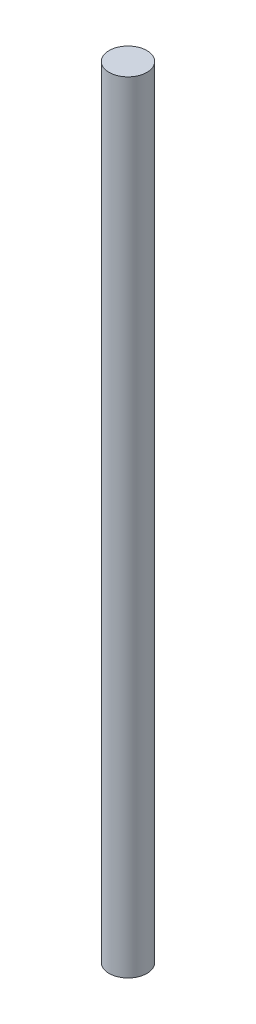
ISO-10303-21;
HEADER;
FILE_DESCRIPTION(('STEP AP214'),'2;1');
FILE_NAME('part.step','',(''),(''),'','','');
FILE_SCHEMA(('AUTOMOTIVE_DESIGN { 1 0 10303 214 1 1 1 1 }'));
ENDSEC;
DATA;
#1=APPLICATION_CONTEXT('core data for automotive mechanical design processes');
#2=APPLICATION_PROTOCOL_DEFINITION('international standard','automotive_design',2000,#1);
#3=PRODUCT_CONTEXT('',#1,'mechanical');
#4=PRODUCT('Part','Part','',(#3));
#5=PRODUCT_RELATED_PRODUCT_CATEGORY('part','',(#4));
#6=PRODUCT_DEFINITION_FORMATION('','',#4);
#7=PRODUCT_DEFINITION_CONTEXT('part definition',#1,'design');
#8=PRODUCT_DEFINITION('design','',#6,#7);
#9=PRODUCT_DEFINITION_SHAPE('','',#8);
#10=(LENGTH_UNIT() NAMED_UNIT(*) SI_UNIT(.MILLI.,.METRE.));
#11=(NAMED_UNIT(*) PLANE_ANGLE_UNIT() SI_UNIT($,.RADIAN.));
#12=(NAMED_UNIT(*) SI_UNIT($,.STERADIAN.) SOLID_ANGLE_UNIT());
#13=UNCERTAINTY_MEASURE_WITH_UNIT(LENGTH_MEASURE(1.E-05),#10,'distance_accuracy_value','');
#14=(GEOMETRIC_REPRESENTATION_CONTEXT(3) GLOBAL_UNCERTAINTY_ASSIGNED_CONTEXT((#13)) GLOBAL_UNIT_ASSIGNED_CONTEXT((#10,
#11,#12)) REPRESENTATION_CONTEXT('',''));
#15=CARTESIAN_POINT('',(0.,0.,0.));
#16=DIRECTION('',(0.,0.,1.));
#17=DIRECTION('',(1.,0.,0.));
#18=AXIS2_PLACEMENT_3D('',#15,#16,#17);
#19=CARTESIAN_POINT('',(0.,262.,0.));
#20=DIRECTION('',(0.,-1.,0.));
#21=DIRECTION('',(0.,0.,-1.));
#22=AXIS2_PLACEMENT_3D('',#19,#20,#21);
#23=CYLINDRICAL_SURFACE('',#22,6.35);
#24=CARTESIAN_POINT('',(0.,0.,0.));
#25=DIRECTION('',(0.,1.,0.));
#26=DIRECTION('',(0.,0.,1.));
#27=AXIS2_PLACEMENT_3D('',#24,#25,#26);
#28=CIRCLE('',#27,6.35);
#29=CARTESIAN_POINT('',(0.,0.,6.35));
#30=VERTEX_POINT('',#29);
#31=EDGE_CURVE('E121',#30,#30,#28,.T.);
#32=ORIENTED_EDGE('',*,*,#31,.T.);
#33=EDGE_LOOP('',(#32));
#34=FACE_BOUND('',#33,.T.);
#35=CARTESIAN_POINT('',(0.,262.,0.));
#36=DIRECTION('',(0.,1.,0.));
#37=DIRECTION('',(0.,0.,1.));
#38=AXIS2_PLACEMENT_3D('',#35,#36,#37);
#39=CIRCLE('',#38,6.35);
#40=CARTESIAN_POINT('',(0.,262.,6.35));
#41=VERTEX_POINT('',#40);
#42=EDGE_CURVE('E123',#41,#41,#39,.T.);
#43=ORIENTED_EDGE('',*,*,#42,.F.);
#44=EDGE_LOOP('',(#43));
#45=FACE_BOUND('',#44,.T.);
#46=CARTESIAN_POINT('',(0.,118.3,0.));
#47=DIRECTION('',(0.,1.,0.));
#48=DIRECTION('',(0.,0.,1.));
#49=AXIS2_PLACEMENT_3D('',#46,#47,#48);
#50=CIRCLE('',#49,6.35);
#51=CARTESIAN_POINT('',(1.5875,118.3,-6.14836106210427));
#52=VERTEX_POINT('',#51);
#53=CARTESIAN_POINT('',(-1.5875,118.3,-6.14836106210428));
#54=VERTEX_POINT('',#53);
#55=EDGE_CURVE('E11',#52,#54,#50,.T.);
#56=ORIENTED_EDGE('',*,*,#55,.F.);
#57=DIRECTION('',(0.,-1.,0.));
#58=VECTOR('',#57,1.);
#59=CARTESIAN_POINT('',(1.5875,262.,-6.14836106210427));
#60=LINE('',#59,#58);
#61=CARTESIAN_POINT('',(1.5875,143.7,-6.14836106210427));
#62=VERTEX_POINT('',#61);
#63=EDGE_CURVE('E68',#52,#62,#60,.F.);
#64=ORIENTED_EDGE('',*,*,#63,.T.);
#65=CARTESIAN_POINT('',(0.,143.7,0.));
#66=DIRECTION('',(0.,1.,0.));
#67=DIRECTION('',(0.,0.,1.));
#68=AXIS2_PLACEMENT_3D('',#65,#66,#67);
#69=CIRCLE('',#68,6.35);
#70=CARTESIAN_POINT('',(-1.5875,143.7,-6.14836106210428));
#71=VERTEX_POINT('',#70);
#72=EDGE_CURVE('E127',#62,#71,#69,.T.);
#73=ORIENTED_EDGE('',*,*,#72,.T.);
#74=DIRECTION('',(0.,-1.,0.));
#75=VECTOR('',#74,1.);
#76=CARTESIAN_POINT('',(-1.5875,262.,-6.14836106210428));
#77=LINE('',#76,#75);
#78=EDGE_CURVE('E53',#71,#54,#77,.T.);
#79=ORIENTED_EDGE('',*,*,#78,.T.);
#80=EDGE_LOOP('',(#56,#64,#73,#79));
#81=FACE_BOUND('',#80,.T.);
#82=ADVANCED_FACE('F45',(#34,#45,#81),#23,.T.);
#83=CARTESIAN_POINT('',(0.,262.,0.));
#84=DIRECTION('',(0.,1.,0.));
#85=DIRECTION('',(0.,0.,1.));
#86=AXIS2_PLACEMENT_3D('',#83,#84,#85);
#87=PLANE('',#86);
#88=ORIENTED_EDGE('',*,*,#42,.T.);
#89=EDGE_LOOP('',(#88));
#90=FACE_BOUND('',#89,.T.);
#91=ADVANCED_FACE('F149',(#90),#87,.T.);
#92=CARTESIAN_POINT('',(0.,0.,0.));
#93=DIRECTION('',(0.,1.,0.));
#94=DIRECTION('',(0.,0.,1.));
#95=AXIS2_PLACEMENT_3D('',#92,#93,#94);
#96=PLANE('',#95);
#97=ORIENTED_EDGE('',*,*,#31,.F.);
#98=EDGE_LOOP('',(#97));
#99=FACE_BOUND('',#98,.T.);
#100=ADVANCED_FACE('F156',(#99),#96,.F.);
#101=CARTESIAN_POINT('',(-1.5875,118.3,-7.74856106210427));
#102=DIRECTION('',(-1.,0.,0.));
#103=DIRECTION('',(0.,0.,1.));
#104=AXIS2_PLACEMENT_3D('',#101,#102,#103);
#105=PLANE('',#104);
#106=DIRECTION('',(0.,0.,1.));
#107=VECTOR('',#106,1.);
#108=CARTESIAN_POINT('',(-1.5875,143.7,-7.74856106210427));
#109=LINE('',#108,#107);
#110=CARTESIAN_POINT('',(-1.5875,143.7,-4.54816106210427));
#111=VERTEX_POINT('',#110);
#112=EDGE_CURVE('E60',#71,#111,#109,.T.);
#113=ORIENTED_EDGE('',*,*,#112,.T.);
#114=DIRECTION('',(0.,1.,0.));
#115=VECTOR('',#114,1.);
#116=CARTESIAN_POINT('',(-1.5875,118.3,-4.54816106210427));
#117=LINE('',#116,#115);
#118=CARTESIAN_POINT('',(-1.5875,118.3,-4.54816106210427));
#119=VERTEX_POINT('',#118);
#120=EDGE_CURVE('E89',#119,#111,#117,.T.);
#121=ORIENTED_EDGE('',*,*,#120,.F.);
#122=DIRECTION('',(0.,0.,1.));
#123=VECTOR('',#122,1.);
#124=CARTESIAN_POINT('',(-1.5875,118.3,-7.74856106210427));
#125=LINE('',#124,#123);
#126=EDGE_CURVE('E111',#54,#119,#125,.T.);
#127=ORIENTED_EDGE('',*,*,#126,.F.);
#128=ORIENTED_EDGE('',*,*,#78,.F.);
#129=EDGE_LOOP('',(#113,#121,#127,#128));
#130=FACE_BOUND('',#129,.T.);
#131=ADVANCED_FACE('F87',(#130),#105,.F.);
#132=CARTESIAN_POINT('',(1.5875,118.3,-7.74856106210427));
#133=DIRECTION('',(1.,0.,0.));
#134=DIRECTION('',(0.,0.,-1.));
#135=AXIS2_PLACEMENT_3D('',#132,#133,#134);
#136=PLANE('',#135);
#137=DIRECTION('',(0.,0.,-1.));
#138=VECTOR('',#137,1.);
#139=CARTESIAN_POINT('',(1.5875,118.3,-7.74856106210427));
#140=LINE('',#139,#138);
#141=CARTESIAN_POINT('',(1.5875,118.3,-4.54816106210427));
#142=VERTEX_POINT('',#141);
#143=EDGE_CURVE('E104',#142,#52,#140,.T.);
#144=ORIENTED_EDGE('',*,*,#143,.F.);
#145=DIRECTION('',(0.,1.,0.));
#146=VECTOR('',#145,1.);
#147=CARTESIAN_POINT('',(1.5875,118.3,-4.54816106210427));
#148=LINE('',#147,#146);
#149=CARTESIAN_POINT('',(1.5875,143.7,-4.54816106210427));
#150=VERTEX_POINT('',#149);
#151=EDGE_CURVE('E103',#142,#150,#148,.T.);
#152=ORIENTED_EDGE('',*,*,#151,.T.);
#153=DIRECTION('',(0.,0.,-1.));
#154=VECTOR('',#153,1.);
#155=CARTESIAN_POINT('',(1.5875,143.7,-7.74856106210427));
#156=LINE('',#155,#154);
#157=EDGE_CURVE('E107',#150,#62,#156,.T.);
#158=ORIENTED_EDGE('',*,*,#157,.T.);
#159=ORIENTED_EDGE('',*,*,#63,.F.);
#160=EDGE_LOOP('',(#144,#152,#158,#159));
#161=FACE_BOUND('',#160,.T.);
#162=ADVANCED_FACE('F137',(#161),#136,.F.);
#163=CARTESIAN_POINT('',(0.,118.3,0.));
#164=DIRECTION('',(0.,1.,0.));
#165=DIRECTION('',(0.,0.,1.));
#166=AXIS2_PLACEMENT_3D('',#163,#164,#165);
#167=PLANE('',#166);
#168=ORIENTED_EDGE('',*,*,#55,.T.);
#169=ORIENTED_EDGE('',*,*,#126,.T.);
#170=DIRECTION('',(1.,0.,0.));
#171=VECTOR('',#170,1.);
#172=CARTESIAN_POINT('',(-1.5875,118.3,-4.54816106210427));
#173=LINE('',#172,#171);
#174=EDGE_CURVE('E101',#119,#142,#173,.T.);
#175=ORIENTED_EDGE('',*,*,#174,.T.);
#176=ORIENTED_EDGE('',*,*,#143,.T.);
#177=EDGE_LOOP('',(#168,#169,#175,#176));
#178=FACE_BOUND('',#177,.T.);
#179=ADVANCED_FACE('F139',(#178),#167,.T.);
#180=CARTESIAN_POINT('',(0.,143.7,0.));
#181=DIRECTION('',(0.,1.,0.));
#182=DIRECTION('',(0.,0.,1.));
#183=AXIS2_PLACEMENT_3D('',#180,#181,#182);
#184=PLANE('',#183);
#185=ORIENTED_EDGE('',*,*,#157,.F.);
#186=DIRECTION('',(1.,0.,0.));
#187=VECTOR('',#186,1.);
#188=CARTESIAN_POINT('',(-1.5875,143.7,-4.54816106210427));
#189=LINE('',#188,#187);
#190=EDGE_CURVE('E94',#111,#150,#189,.T.);
#191=ORIENTED_EDGE('',*,*,#190,.F.);
#192=ORIENTED_EDGE('',*,*,#112,.F.);
#193=ORIENTED_EDGE('',*,*,#72,.F.);
#194=EDGE_LOOP('',(#185,#191,#192,#193));
#195=FACE_BOUND('',#194,.T.);
#196=ADVANCED_FACE('F106',(#195),#184,.F.);
#197=CARTESIAN_POINT('',(-1.5875,118.3,-4.54816106210427));
#198=DIRECTION('',(0.,0.,1.));
#199=DIRECTION('',(1.,0.,0.));
#200=AXIS2_PLACEMENT_3D('',#197,#198,#199);
#201=PLANE('',#200);
#202=ORIENTED_EDGE('',*,*,#151,.F.);
#203=ORIENTED_EDGE('',*,*,#174,.F.);
#204=ORIENTED_EDGE('',*,*,#120,.T.);
#205=ORIENTED_EDGE('',*,*,#190,.T.);
#206=EDGE_LOOP('',(#202,#203,#204,#205));
#207=FACE_BOUND('',#206,.T.);
#208=ADVANCED_FACE('F98',(#207),#201,.F.);
#209=CLOSED_SHELL('',(#82,#91,#100,#131,#162,#179,#196,#208));
#210=MANIFOLD_SOLID_BREP('B2',#209);
#211=ADVANCED_BREP_SHAPE_REPRESENTATION('',(#18,#210),#14);
#212=SHAPE_DEFINITION_REPRESENTATION(#9,#211);
ENDSEC;
END-ISO-10303-21;
